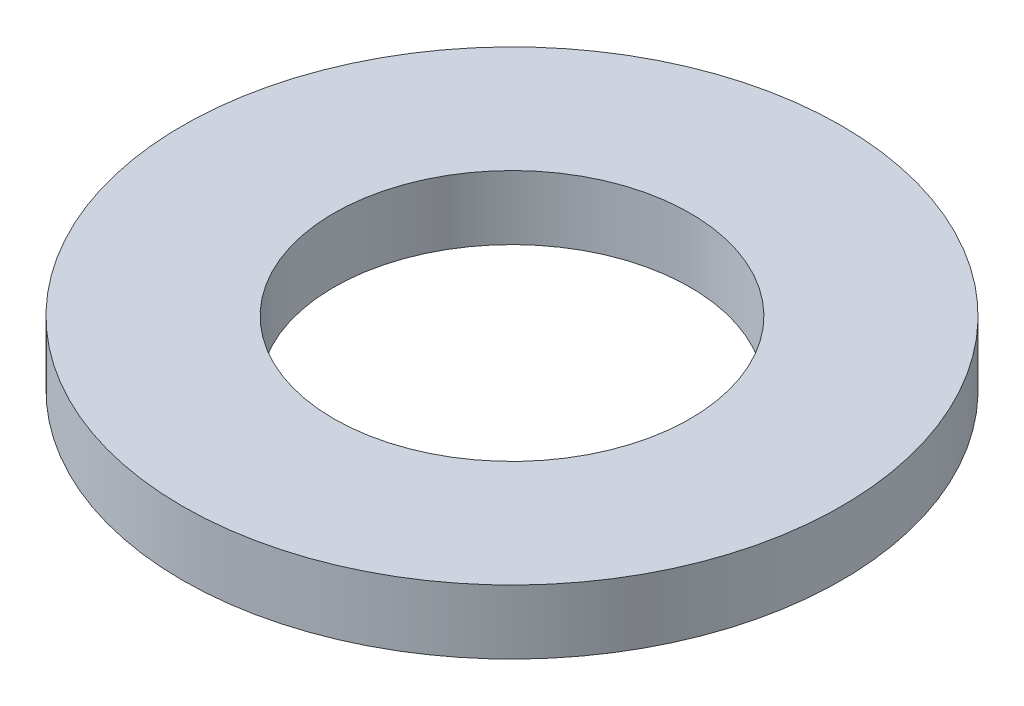
ISO-10303-21;
HEADER;
FILE_DESCRIPTION(('STEP AP214'),'2;1');
FILE_NAME('part.step','',(''),(''),'','','');
FILE_SCHEMA(('AUTOMOTIVE_DESIGN { 1 0 10303 214 1 1 1 1 }'));
ENDSEC;
DATA;
#1=APPLICATION_CONTEXT('core data for automotive mechanical design processes');
#2=APPLICATION_PROTOCOL_DEFINITION('international standard','automotive_design',2000,#1);
#3=PRODUCT_CONTEXT('',#1,'mechanical');
#4=PRODUCT('Part','Part','',(#3));
#5=PRODUCT_RELATED_PRODUCT_CATEGORY('part','',(#4));
#6=PRODUCT_DEFINITION_FORMATION('','',#4);
#7=PRODUCT_DEFINITION_CONTEXT('part definition',#1,'design');
#8=PRODUCT_DEFINITION('design','',#6,#7);
#9=PRODUCT_DEFINITION_SHAPE('','',#8);
#10=(LENGTH_UNIT() NAMED_UNIT(*) SI_UNIT(.MILLI.,.METRE.));
#11=(NAMED_UNIT(*) PLANE_ANGLE_UNIT() SI_UNIT($,.RADIAN.));
#12=(NAMED_UNIT(*) SI_UNIT($,.STERADIAN.) SOLID_ANGLE_UNIT());
#13=UNCERTAINTY_MEASURE_WITH_UNIT(LENGTH_MEASURE(1.E-05),#10,'distance_accuracy_value','');
#14=(GEOMETRIC_REPRESENTATION_CONTEXT(3) GLOBAL_UNCERTAINTY_ASSIGNED_CONTEXT((#13)) GLOBAL_UNIT_ASSIGNED_CONTEXT((#10,
#11,#12)) REPRESENTATION_CONTEXT('',''));
#15=CARTESIAN_POINT('',(0.,0.,0.));
#16=DIRECTION('',(0.,0.,1.));
#17=DIRECTION('',(1.,0.,0.));
#18=AXIS2_PLACEMENT_3D('',#15,#16,#17);
#19=CARTESIAN_POINT('',(0.,18.,0.));
#20=DIRECTION('',(0.,-1.,0.));
#21=DIRECTION('',(0.,0.,-1.));
#22=AXIS2_PLACEMENT_3D('',#19,#20,#21);
#23=CYLINDRICAL_SURFACE('',#22,92.5);
#24=CARTESIAN_POINT('',(0.,18.,0.));
#25=DIRECTION('',(0.,1.,0.));
#26=DIRECTION('',(0.,0.,1.));
#27=AXIS2_PLACEMENT_3D('',#24,#25,#26);
#28=CIRCLE('',#27,92.5);
#29=CARTESIAN_POINT('',(0.,18.,92.5));
#30=VERTEX_POINT('',#29);
#31=EDGE_CURVE('E10',#30,#30,#28,.T.);
#32=ORIENTED_EDGE('',*,*,#31,.F.);
#33=EDGE_LOOP('',(#32));
#34=FACE_BOUND('',#33,.T.);
#35=CARTESIAN_POINT('',(0.,0.,0.));
#36=DIRECTION('',(0.,1.,0.));
#37=DIRECTION('',(0.,0.,1.));
#38=AXIS2_PLACEMENT_3D('',#35,#36,#37);
#39=CIRCLE('',#38,92.5);
#40=CARTESIAN_POINT('',(0.,0.,92.5));
#41=VERTEX_POINT('',#40);
#42=EDGE_CURVE('E37',#41,#41,#39,.T.);
#43=ORIENTED_EDGE('',*,*,#42,.T.);
#44=EDGE_LOOP('',(#43));
#45=FACE_BOUND('',#44,.T.);
#46=ADVANCED_FACE('F40',(#34,#45),#23,.T.);
#47=CARTESIAN_POINT('',(0.,18.,0.));
#48=DIRECTION('',(0.,1.,0.));
#49=DIRECTION('',(0.,0.,1.));
#50=AXIS2_PLACEMENT_3D('',#47,#48,#49);
#51=PLANE('',#50);
#52=CARTESIAN_POINT('',(0.,18.,0.));
#53=DIRECTION('',(0.,1.,0.));
#54=DIRECTION('',(0.,0.,1.));
#55=AXIS2_PLACEMENT_3D('',#52,#53,#54);
#56=CIRCLE('',#55,50.);
#57=CARTESIAN_POINT('',(0.,18.,50.));
#58=VERTEX_POINT('',#57);
#59=EDGE_CURVE('E50',#58,#58,#56,.T.);
#60=ORIENTED_EDGE('',*,*,#59,.F.);
#61=EDGE_LOOP('',(#60));
#62=FACE_BOUND('',#61,.T.);
#63=ORIENTED_EDGE('',*,*,#31,.T.);
#64=EDGE_LOOP('',(#63));
#65=FACE_BOUND('',#64,.T.);
#66=ADVANCED_FACE('F59',(#62,#65),#51,.T.);
#67=CARTESIAN_POINT('',(0.,0.,0.));
#68=DIRECTION('',(0.,1.,0.));
#69=DIRECTION('',(0.,0.,1.));
#70=AXIS2_PLACEMENT_3D('',#67,#68,#69);
#71=PLANE('',#70);
#72=CARTESIAN_POINT('',(0.,0.,0.));
#73=DIRECTION('',(0.,1.,0.));
#74=DIRECTION('',(0.,0.,1.));
#75=AXIS2_PLACEMENT_3D('',#72,#73,#74);
#76=CIRCLE('',#75,50.);
#77=CARTESIAN_POINT('',(0.,0.,50.));
#78=VERTEX_POINT('',#77);
#79=EDGE_CURVE('E47',#78,#78,#76,.T.);
#80=ORIENTED_EDGE('',*,*,#79,.T.);
#81=EDGE_LOOP('',(#80));
#82=FACE_BOUND('',#81,.T.);
#83=ORIENTED_EDGE('',*,*,#42,.F.);
#84=EDGE_LOOP('',(#83));
#85=FACE_BOUND('',#84,.T.);
#86=ADVANCED_FACE('F58',(#82,#85),#71,.F.);
#87=CARTESIAN_POINT('',(0.,18.,0.));
#88=DIRECTION('',(0.,-1.,0.));
#89=DIRECTION('',(0.,0.,-1.));
#90=AXIS2_PLACEMENT_3D('',#87,#88,#89);
#91=CYLINDRICAL_SURFACE('',#90,50.);
#92=ORIENTED_EDGE('',*,*,#59,.T.);
#93=EDGE_LOOP('',(#92));
#94=FACE_BOUND('',#93,.T.);
#95=ORIENTED_EDGE('',*,*,#79,.F.);
#96=EDGE_LOOP('',(#95));
#97=FACE_BOUND('',#96,.T.);
#98=ADVANCED_FACE('F54',(#94,#97),#91,.F.);
#99=CLOSED_SHELL('',(#46,#66,#86,#98));
#100=MANIFOLD_SOLID_BREP('B2',#99);
#101=ADVANCED_BREP_SHAPE_REPRESENTATION('',(#18,#100),#14);
#102=SHAPE_DEFINITION_REPRESENTATION(#9,#101);
ENDSEC;
END-ISO-10303-21;
